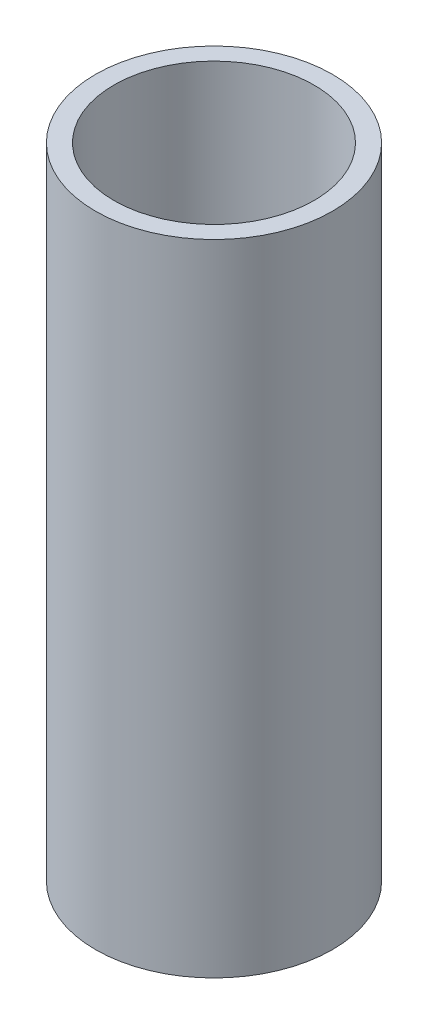
ISO-10303-21;
HEADER;
FILE_DESCRIPTION(('STEP AP214'),'2;1');
FILE_NAME('part.step','',(''),(''),'','','');
FILE_SCHEMA(('AUTOMOTIVE_DESIGN { 1 0 10303 214 1 1 1 1 }'));
ENDSEC;
DATA;
#1=APPLICATION_CONTEXT('core data for automotive mechanical design processes');
#2=APPLICATION_PROTOCOL_DEFINITION('international standard','automotive_design',2000,#1);
#3=PRODUCT_CONTEXT('',#1,'mechanical');
#4=PRODUCT('Part','Part','',(#3));
#5=PRODUCT_RELATED_PRODUCT_CATEGORY('part','',(#4));
#6=PRODUCT_DEFINITION_FORMATION('','',#4);
#7=PRODUCT_DEFINITION_CONTEXT('part definition',#1,'design');
#8=PRODUCT_DEFINITION('design','',#6,#7);
#9=PRODUCT_DEFINITION_SHAPE('','',#8);
#10=(LENGTH_UNIT() NAMED_UNIT(*) SI_UNIT(.MILLI.,.METRE.));
#11=(NAMED_UNIT(*) PLANE_ANGLE_UNIT() SI_UNIT($,.RADIAN.));
#12=(NAMED_UNIT(*) SI_UNIT($,.STERADIAN.) SOLID_ANGLE_UNIT());
#13=UNCERTAINTY_MEASURE_WITH_UNIT(LENGTH_MEASURE(1.E-05),#10,'distance_accuracy_value','');
#14=(GEOMETRIC_REPRESENTATION_CONTEXT(3) GLOBAL_UNCERTAINTY_ASSIGNED_CONTEXT((#13)) GLOBAL_UNIT_ASSIGNED_CONTEXT((#10,
#11,#12)) REPRESENTATION_CONTEXT('',''));
#15=CARTESIAN_POINT('',(0.,0.,0.));
#16=DIRECTION('',(0.,0.,1.));
#17=DIRECTION('',(1.,0.,0.));
#18=AXIS2_PLACEMENT_3D('',#15,#16,#17);
#19=CARTESIAN_POINT('',(0.,134.893810303935,0.));
#20=DIRECTION('',(0.,-1.,0.));
#21=DIRECTION('',(0.,0.,-1.));
#22=AXIS2_PLACEMENT_3D('',#19,#20,#21);
#23=CYLINDRICAL_SURFACE('',#22,25.);
#24=CARTESIAN_POINT('',(0.,134.893810303935,0.));
#25=DIRECTION('',(0.,1.,0.));
#26=DIRECTION('',(0.,0.,1.));
#27=AXIS2_PLACEMENT_3D('',#24,#25,#26);
#28=CIRCLE('',#27,25.);
#29=CARTESIAN_POINT('',(0.,134.893810303935,25.));
#30=VERTEX_POINT('',#29);
#31=EDGE_CURVE('E10',#30,#30,#28,.T.);
#32=ORIENTED_EDGE('',*,*,#31,.F.);
#33=EDGE_LOOP('',(#32));
#34=FACE_BOUND('',#33,.T.);
#35=CARTESIAN_POINT('',(0.,0.,0.));
#36=DIRECTION('',(0.,1.,0.));
#37=DIRECTION('',(0.,0.,1.));
#38=AXIS2_PLACEMENT_3D('',#35,#36,#37);
#39=CIRCLE('',#38,25.);
#40=CARTESIAN_POINT('',(0.,0.,25.));
#41=VERTEX_POINT('',#40);
#42=EDGE_CURVE('E37',#41,#41,#39,.T.);
#43=ORIENTED_EDGE('',*,*,#42,.T.);
#44=EDGE_LOOP('',(#43));
#45=FACE_BOUND('',#44,.T.);
#46=ADVANCED_FACE('F40',(#34,#45),#23,.T.);
#47=CARTESIAN_POINT('',(0.,134.893810303935,0.));
#48=DIRECTION('',(0.,1.,0.));
#49=DIRECTION('',(0.,0.,1.));
#50=AXIS2_PLACEMENT_3D('',#47,#48,#49);
#51=PLANE('',#50);
#52=CARTESIAN_POINT('',(0.,134.893810303935,0.));
#53=DIRECTION('',(0.,1.,0.));
#54=DIRECTION('',(0.,0.,1.));
#55=AXIS2_PLACEMENT_3D('',#52,#53,#54);
#56=CIRCLE('',#55,21.1101351458438);
#57=CARTESIAN_POINT('',(0.,134.893810303935,21.1101351458438));
#58=VERTEX_POINT('',#57);
#59=EDGE_CURVE('E50',#58,#58,#56,.T.);
#60=ORIENTED_EDGE('',*,*,#59,.F.);
#61=EDGE_LOOP('',(#60));
#62=FACE_BOUND('',#61,.T.);
#63=ORIENTED_EDGE('',*,*,#31,.T.);
#64=EDGE_LOOP('',(#63));
#65=FACE_BOUND('',#64,.T.);
#66=ADVANCED_FACE('F59',(#62,#65),#51,.T.);
#67=CARTESIAN_POINT('',(0.,0.,0.));
#68=DIRECTION('',(0.,1.,0.));
#69=DIRECTION('',(0.,0.,1.));
#70=AXIS2_PLACEMENT_3D('',#67,#68,#69);
#71=PLANE('',#70);
#72=CARTESIAN_POINT('',(0.,0.,0.));
#73=DIRECTION('',(0.,1.,0.));
#74=DIRECTION('',(0.,0.,1.));
#75=AXIS2_PLACEMENT_3D('',#72,#73,#74);
#76=CIRCLE('',#75,21.1101351458438);
#77=CARTESIAN_POINT('',(0.,0.,21.1101351458438));
#78=VERTEX_POINT('',#77);
#79=EDGE_CURVE('E47',#78,#78,#76,.T.);
#80=ORIENTED_EDGE('',*,*,#79,.T.);
#81=EDGE_LOOP('',(#80));
#82=FACE_BOUND('',#81,.T.);
#83=ORIENTED_EDGE('',*,*,#42,.F.);
#84=EDGE_LOOP('',(#83));
#85=FACE_BOUND('',#84,.T.);
#86=ADVANCED_FACE('F58',(#82,#85),#71,.F.);
#87=CARTESIAN_POINT('',(0.,134.893810303935,0.));
#88=DIRECTION('',(0.,-1.,0.));
#89=DIRECTION('',(0.,0.,-1.));
#90=AXIS2_PLACEMENT_3D('',#87,#88,#89);
#91=CYLINDRICAL_SURFACE('',#90,21.1101351458438);
#92=ORIENTED_EDGE('',*,*,#59,.T.);
#93=EDGE_LOOP('',(#92));
#94=FACE_BOUND('',#93,.T.);
#95=ORIENTED_EDGE('',*,*,#79,.F.);
#96=EDGE_LOOP('',(#95));
#97=FACE_BOUND('',#96,.T.);
#98=ADVANCED_FACE('F54',(#94,#97),#91,.F.);
#99=CLOSED_SHELL('',(#46,#66,#86,#98));
#100=MANIFOLD_SOLID_BREP('B2',#99);
#101=ADVANCED_BREP_SHAPE_REPRESENTATION('',(#18,#100),#14);
#102=SHAPE_DEFINITION_REPRESENTATION(#9,#101);
ENDSEC;
END-ISO-10303-21;
